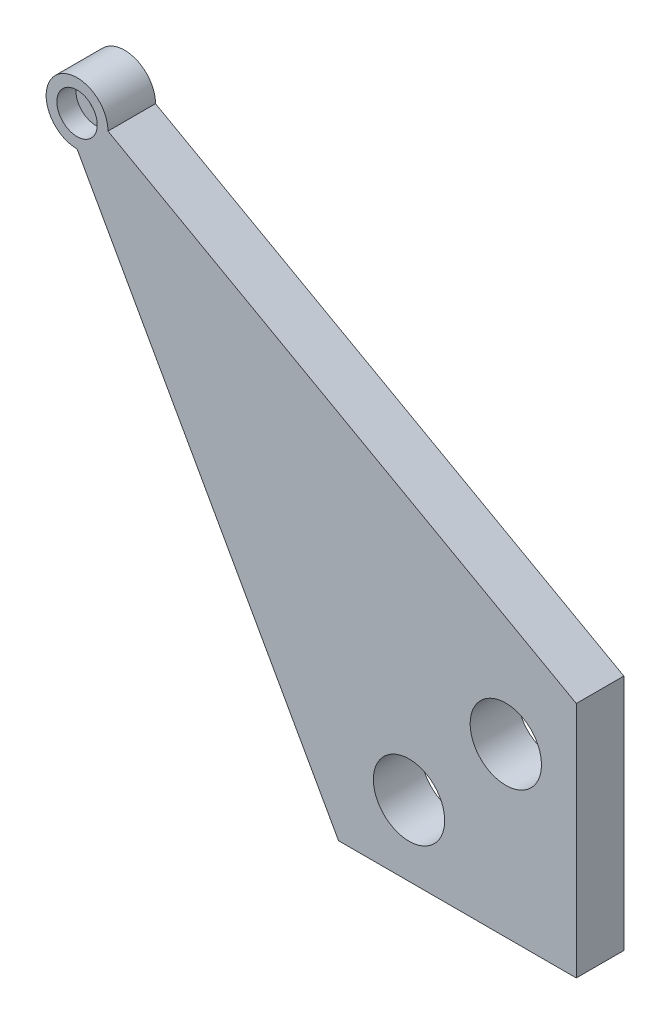
ISO-10303-21;
HEADER;
FILE_DESCRIPTION(('STEP AP214'),'2;1');
FILE_NAME('part.step','',(''),(''),'','','');
FILE_SCHEMA(('AUTOMOTIVE_DESIGN { 1 0 10303 214 1 1 1 1 }'));
ENDSEC;
DATA;
#1=APPLICATION_CONTEXT('core data for automotive mechanical design processes');
#2=APPLICATION_PROTOCOL_DEFINITION('international standard','automotive_design',2000,#1);
#3=PRODUCT_CONTEXT('',#1,'mechanical');
#4=PRODUCT('Part','Part','',(#3));
#5=PRODUCT_RELATED_PRODUCT_CATEGORY('part','',(#4));
#6=PRODUCT_DEFINITION_FORMATION('','',#4);
#7=PRODUCT_DEFINITION_CONTEXT('part definition',#1,'design');
#8=PRODUCT_DEFINITION('design','',#6,#7);
#9=PRODUCT_DEFINITION_SHAPE('','',#8);
#10=(LENGTH_UNIT() NAMED_UNIT(*) SI_UNIT(.MILLI.,.METRE.));
#11=(NAMED_UNIT(*) PLANE_ANGLE_UNIT() SI_UNIT($,.RADIAN.));
#12=(NAMED_UNIT(*) SI_UNIT($,.STERADIAN.) SOLID_ANGLE_UNIT());
#13=UNCERTAINTY_MEASURE_WITH_UNIT(LENGTH_MEASURE(1.E-05),#10,'distance_accuracy_value','');
#14=(GEOMETRIC_REPRESENTATION_CONTEXT(3) GLOBAL_UNCERTAINTY_ASSIGNED_CONTEXT((#13)) GLOBAL_UNIT_ASSIGNED_CONTEXT((#10,
#11,#12)) REPRESENTATION_CONTEXT('',''));
#15=CARTESIAN_POINT('',(0.,0.,0.));
#16=DIRECTION('',(0.,0.,1.));
#17=DIRECTION('',(1.,0.,0.));
#18=AXIS2_PLACEMENT_3D('',#15,#16,#17);
#19=CARTESIAN_POINT('',(0.,0.,5.));
#20=DIRECTION('',(-1.,0.,0.));
#21=DIRECTION('',(0.,1.,0.));
#22=AXIS2_PLACEMENT_3D('',#19,#20,#21);
#23=PLANE('',#22);
#24=DIRECTION('',(0.,-1.,0.));
#25=VECTOR('',#24,1.);
#26=CARTESIAN_POINT('',(0.,0.,-5.));
#27=LINE('',#26,#25);
#28=CARTESIAN_POINT('',(0.,50.,-5.));
#29=VERTEX_POINT('',#28);
#30=CARTESIAN_POINT('',(0.,0.,-5.));
#31=VERTEX_POINT('',#30);
#32=EDGE_CURVE('E119',#29,#31,#27,.T.);
#33=ORIENTED_EDGE('',*,*,#32,.F.);
#34=DIRECTION('',(0.,0.,-1.));
#35=VECTOR('',#34,1.);
#36=CARTESIAN_POINT('',(0.,50.,5.));
#37=LINE('',#36,#35);
#38=CARTESIAN_POINT('',(0.,50.,5.));
#39=VERTEX_POINT('',#38);
#40=EDGE_CURVE('E118',#39,#29,#37,.T.);
#41=ORIENTED_EDGE('',*,*,#40,.F.);
#42=DIRECTION('',(0.,-1.,0.));
#43=VECTOR('',#42,1.);
#44=CARTESIAN_POINT('',(0.,0.,5.));
#45=LINE('',#44,#43);
#46=CARTESIAN_POINT('',(0.,0.,5.));
#47=VERTEX_POINT('',#46);
#48=EDGE_CURVE('E112',#39,#47,#45,.T.);
#49=ORIENTED_EDGE('',*,*,#48,.T.);
#50=DIRECTION('',(0.,0.,-1.));
#51=VECTOR('',#50,1.);
#52=CARTESIAN_POINT('',(0.,0.,5.));
#53=LINE('',#52,#51);
#54=EDGE_CURVE('E11',#47,#31,#53,.T.);
#55=ORIENTED_EDGE('',*,*,#54,.T.);
#56=EDGE_LOOP('',(#33,#41,#49,#55));
#57=FACE_BOUND('',#56,.T.);
#58=ADVANCED_FACE('F38',(#57),#23,.F.);
#59=CARTESIAN_POINT('',(0.,0.,5.));
#60=DIRECTION('',(0.,1.,0.));
#61=DIRECTION('',(0.,0.,1.));
#62=AXIS2_PLACEMENT_3D('',#59,#60,#61);
#63=PLANE('',#62);
#64=DIRECTION('',(-1.,0.,0.));
#65=VECTOR('',#64,1.);
#66=CARTESIAN_POINT('',(0.,0.,-5.));
#67=LINE('',#66,#65);
#68=CARTESIAN_POINT('',(-50.,0.,-5.));
#69=VERTEX_POINT('',#68);
#70=EDGE_CURVE('E122',#31,#69,#67,.T.);
#71=ORIENTED_EDGE('',*,*,#70,.F.);
#72=ORIENTED_EDGE('',*,*,#54,.F.);
#73=DIRECTION('',(-1.,0.,0.));
#74=VECTOR('',#73,1.);
#75=CARTESIAN_POINT('',(0.,0.,5.));
#76=LINE('',#75,#74);
#77=CARTESIAN_POINT('',(-50.,0.,5.));
#78=VERTEX_POINT('',#77);
#79=EDGE_CURVE('E84',#47,#78,#76,.T.);
#80=ORIENTED_EDGE('',*,*,#79,.T.);
#81=DIRECTION('',(0.,0.,-1.));
#82=VECTOR('',#81,1.);
#83=CARTESIAN_POINT('',(-50.,0.,5.));
#84=LINE('',#83,#82);
#85=EDGE_CURVE('E47',#78,#69,#84,.T.);
#86=ORIENTED_EDGE('',*,*,#85,.T.);
#87=EDGE_LOOP('',(#71,#72,#80,#86));
#88=FACE_BOUND('',#87,.T.);
#89=ADVANCED_FACE('F139',(#88),#63,.F.);
#90=CARTESIAN_POINT('',(-50.,0.,5.));
#91=DIRECTION('',(0.873109961084313,0.487523328524236,0.));
#92=DIRECTION('',(0.487523328524236,-0.873109961084313,0.));
#93=AXIS2_PLACEMENT_3D('',#90,#91,#92);
#94=PLANE('',#93);
#95=DIRECTION('',(-0.487523328524236,0.873109961084313,0.));
#96=VECTOR('',#95,1.);
#97=CARTESIAN_POINT('',(-50.,0.,-5.));
#98=LINE('',#97,#96);
#99=CARTESIAN_POINT('',(-105.,98.4999999999999,-5.));
#100=VERTEX_POINT('',#99);
#101=EDGE_CURVE('E127',#69,#100,#98,.T.);
#102=ORIENTED_EDGE('',*,*,#101,.F.);
#103=ORIENTED_EDGE('',*,*,#85,.F.);
#104=DIRECTION('',(-0.487523328524236,0.873109961084313,0.));
#105=VECTOR('',#104,1.);
#106=CARTESIAN_POINT('',(-50.,0.,5.));
#107=LINE('',#106,#105);
#108=CARTESIAN_POINT('',(-105.,98.4999999999999,5.));
#109=VERTEX_POINT('',#108);
#110=EDGE_CURVE('E93',#78,#109,#107,.T.);
#111=ORIENTED_EDGE('',*,*,#110,.T.);
#112=DIRECTION('',(0.,0.,-1.));
#113=VECTOR('',#112,1.);
#114=CARTESIAN_POINT('',(-105.,98.4999999999999,5.));
#115=LINE('',#114,#113);
#116=EDGE_CURVE('E99',#109,#100,#115,.T.);
#117=ORIENTED_EDGE('',*,*,#116,.T.);
#118=EDGE_LOOP('',(#102,#103,#111,#117));
#119=FACE_BOUND('',#118,.T.);
#120=ADVANCED_FACE('F107',(#119),#94,.F.);
#121=CARTESIAN_POINT('',(-105.,105.,5.));
#122=DIRECTION('',(0.,0.,-1.));
#123=DIRECTION('',(1.,0.,0.));
#124=AXIS2_PLACEMENT_3D('',#121,#122,#123);
#125=CYLINDRICAL_SURFACE('',#124,6.50000000000001);
#126=CARTESIAN_POINT('',(-105.,105.,-5.));
#127=DIRECTION('',(0.,0.,-1.));
#128=DIRECTION('',(-1.,0.,0.));
#129=AXIS2_PLACEMENT_3D('',#126,#127,#128);
#130=CIRCLE('',#129,6.50000000000001);
#131=CARTESIAN_POINT('',(-98.5,105.,-5.));
#132=VERTEX_POINT('',#131);
#133=EDGE_CURVE('E101',#100,#132,#130,.T.);
#134=ORIENTED_EDGE('',*,*,#133,.F.);
#135=ORIENTED_EDGE('',*,*,#116,.F.);
#136=CARTESIAN_POINT('',(-105.,105.,5.));
#137=DIRECTION('',(0.,0.,-1.));
#138=DIRECTION('',(-1.,0.,0.));
#139=AXIS2_PLACEMENT_3D('',#136,#137,#138);
#140=CIRCLE('',#139,6.50000000000001);
#141=CARTESIAN_POINT('',(-98.5,105.,5.));
#142=VERTEX_POINT('',#141);
#143=EDGE_CURVE('E89',#109,#142,#140,.T.);
#144=ORIENTED_EDGE('',*,*,#143,.T.);
#145=DIRECTION('',(0.,0.,-1.));
#146=VECTOR('',#145,1.);
#147=CARTESIAN_POINT('',(-98.5,105.,5.));
#148=LINE('',#147,#146);
#149=EDGE_CURVE('E105',#142,#132,#148,.T.);
#150=ORIENTED_EDGE('',*,*,#149,.T.);
#151=EDGE_LOOP('',(#134,#135,#144,#150));
#152=FACE_BOUND('',#151,.T.);
#153=ADVANCED_FACE('F100',(#152),#125,.T.);
#154=CARTESIAN_POINT('',(0.,50.,5.));
#155=DIRECTION('',(-0.487523328524235,-0.873109961084313,0.));
#156=DIRECTION('',(-0.873109961084313,0.487523328524235,0.));
#157=AXIS2_PLACEMENT_3D('',#154,#155,#156);
#158=PLANE('',#157);
#159=DIRECTION('',(0.873109961084313,-0.487523328524235,0.));
#160=VECTOR('',#159,1.);
#161=CARTESIAN_POINT('',(0.,50.,-5.));
#162=LINE('',#161,#160);
#163=EDGE_CURVE('E72',#132,#29,#162,.T.);
#164=ORIENTED_EDGE('',*,*,#163,.F.);
#165=ORIENTED_EDGE('',*,*,#149,.F.);
#166=DIRECTION('',(0.873109961084313,-0.487523328524235,0.));
#167=VECTOR('',#166,1.);
#168=CARTESIAN_POINT('',(0.,50.,5.));
#169=LINE('',#168,#167);
#170=EDGE_CURVE('E55',#142,#39,#169,.T.);
#171=ORIENTED_EDGE('',*,*,#170,.T.);
#172=ORIENTED_EDGE('',*,*,#40,.T.);
#173=EDGE_LOOP('',(#164,#165,#171,#172));
#174=FACE_BOUND('',#173,.T.);
#175=ADVANCED_FACE('F209',(#174),#158,.F.);
#176=CARTESIAN_POINT('',(-105.,105.,5.));
#177=DIRECTION('',(0.,0.,1.));
#178=DIRECTION('',(-1.,0.,0.));
#179=AXIS2_PLACEMENT_3D('',#176,#177,#178);
#180=PLANE('',#179);
#181=CARTESIAN_POINT('',(-14.8255588340632,35.1744411659368,5.));
#182=DIRECTION('',(0.,0.,-1.));
#183=DIRECTION('',(-1.,0.,0.));
#184=AXIS2_PLACEMENT_3D('',#181,#182,#183);
#185=CIRCLE('',#184,7.5);
#186=CARTESIAN_POINT('',(-22.3255588340632,35.1744411659368,5.));
#187=VERTEX_POINT('',#186);
#188=EDGE_CURVE('E171',#187,#187,#185,.T.);
#189=ORIENTED_EDGE('',*,*,#188,.T.);
#190=EDGE_LOOP('',(#189));
#191=FACE_BOUND('',#190,.T.);
#192=CARTESIAN_POINT('',(-35.1744411659368,14.8255588340632,5.));
#193=DIRECTION('',(0.,0.,-1.));
#194=DIRECTION('',(-1.,0.,0.));
#195=AXIS2_PLACEMENT_3D('',#192,#193,#194);
#196=CIRCLE('',#195,7.5);
#197=CARTESIAN_POINT('',(-42.6744411659368,14.8255588340632,5.));
#198=VERTEX_POINT('',#197);
#199=EDGE_CURVE('E163',#198,#198,#196,.T.);
#200=ORIENTED_EDGE('',*,*,#199,.T.);
#201=EDGE_LOOP('',(#200));
#202=FACE_BOUND('',#201,.T.);
#203=CARTESIAN_POINT('',(-105.,105.,5.));
#204=DIRECTION('',(0.,0.,-1.));
#205=DIRECTION('',(-1.,0.,0.));
#206=AXIS2_PLACEMENT_3D('',#203,#204,#205);
#207=CIRCLE('',#206,4.25000000000001);
#208=CARTESIAN_POINT('',(-109.25,105.,5.));
#209=VERTEX_POINT('',#208);
#210=EDGE_CURVE('E147',#209,#209,#207,.T.);
#211=ORIENTED_EDGE('',*,*,#210,.T.);
#212=EDGE_LOOP('',(#211));
#213=FACE_BOUND('',#212,.T.);
#214=ORIENTED_EDGE('',*,*,#48,.F.);
#215=ORIENTED_EDGE('',*,*,#170,.F.);
#216=ORIENTED_EDGE('',*,*,#143,.F.);
#217=ORIENTED_EDGE('',*,*,#110,.F.);
#218=ORIENTED_EDGE('',*,*,#79,.F.);
#219=EDGE_LOOP('',(#214,#215,#216,#217,#218));
#220=FACE_BOUND('',#219,.T.);
#221=ADVANCED_FACE('F91',(#191,#202,#213,#220),#180,.T.);
#222=CARTESIAN_POINT('',(-105.,105.,-5.));
#223=DIRECTION('',(0.,0.,1.));
#224=DIRECTION('',(-1.,0.,0.));
#225=AXIS2_PLACEMENT_3D('',#222,#223,#224);
#226=PLANE('',#225);
#227=CARTESIAN_POINT('',(-14.8255588340632,35.1744411659368,-5.));
#228=DIRECTION('',(0.,0.,-1.));
#229=DIRECTION('',(-1.,0.,0.));
#230=AXIS2_PLACEMENT_3D('',#227,#228,#229);
#231=CIRCLE('',#230,7.5);
#232=CARTESIAN_POINT('',(-22.3255588340632,35.1744411659368,-5.));
#233=VERTEX_POINT('',#232);
#234=EDGE_CURVE('E159',#233,#233,#231,.T.);
#235=ORIENTED_EDGE('',*,*,#234,.F.);
#236=EDGE_LOOP('',(#235));
#237=FACE_BOUND('',#236,.T.);
#238=CARTESIAN_POINT('',(-35.1744411659368,14.8255588340632,-5.));
#239=DIRECTION('',(0.,0.,-1.));
#240=DIRECTION('',(-1.,0.,0.));
#241=AXIS2_PLACEMENT_3D('',#238,#239,#240);
#242=CIRCLE('',#241,7.5);
#243=CARTESIAN_POINT('',(-42.6744411659368,14.8255588340632,-5.));
#244=VERTEX_POINT('',#243);
#245=EDGE_CURVE('E167',#244,#244,#242,.T.);
#246=ORIENTED_EDGE('',*,*,#245,.F.);
#247=EDGE_LOOP('',(#246));
#248=FACE_BOUND('',#247,.T.);
#249=CARTESIAN_POINT('',(-105.,105.,-5.));
#250=DIRECTION('',(0.,0.,-1.));
#251=DIRECTION('',(-1.,0.,0.));
#252=AXIS2_PLACEMENT_3D('',#249,#250,#251);
#253=CIRCLE('',#252,1.5);
#254=CARTESIAN_POINT('',(-106.5,105.,-5.));
#255=VERTEX_POINT('',#254);
#256=EDGE_CURVE('E151',#255,#255,#253,.T.);
#257=ORIENTED_EDGE('',*,*,#256,.F.);
#258=EDGE_LOOP('',(#257));
#259=FACE_BOUND('',#258,.T.);
#260=ORIENTED_EDGE('',*,*,#32,.T.);
#261=ORIENTED_EDGE('',*,*,#70,.T.);
#262=ORIENTED_EDGE('',*,*,#101,.T.);
#263=ORIENTED_EDGE('',*,*,#133,.T.);
#264=ORIENTED_EDGE('',*,*,#163,.T.);
#265=EDGE_LOOP('',(#260,#261,#262,#263,#264));
#266=FACE_BOUND('',#265,.T.);
#267=ADVANCED_FACE('F140',(#237,#248,#259,#266),#226,.F.);
#268=CARTESIAN_POINT('',(-105.,105.,1.));
#269=DIRECTION('',(0.,0.,1.));
#270=DIRECTION('',(-1.,0.,0.));
#271=AXIS2_PLACEMENT_3D('',#268,#269,#270);
#272=CYLINDRICAL_SURFACE('',#271,4.25000000000001);
#273=CARTESIAN_POINT('',(-105.,105.,1.));
#274=DIRECTION('',(0.,0.,-1.));
#275=DIRECTION('',(-1.,0.,0.));
#276=AXIS2_PLACEMENT_3D('',#273,#274,#275);
#277=CIRCLE('',#276,4.25000000000001);
#278=CARTESIAN_POINT('',(-109.25,105.,1.));
#279=VERTEX_POINT('',#278);
#280=EDGE_CURVE('E123',#279,#279,#277,.T.);
#281=ORIENTED_EDGE('',*,*,#280,.T.);
#282=EDGE_LOOP('',(#281));
#283=FACE_BOUND('',#282,.T.);
#284=ORIENTED_EDGE('',*,*,#210,.F.);
#285=EDGE_LOOP('',(#284));
#286=FACE_BOUND('',#285,.T.);
#287=ADVANCED_FACE('F184',(#283,#286),#272,.F.);
#288=CARTESIAN_POINT('',(-105.,105.,1.));
#289=DIRECTION('',(0.,0.,1.));
#290=DIRECTION('',(-1.,0.,0.));
#291=AXIS2_PLACEMENT_3D('',#288,#289,#290);
#292=PLANE('',#291);
#293=CARTESIAN_POINT('',(-105.,105.,1.));
#294=DIRECTION('',(0.,0.,-1.));
#295=DIRECTION('',(-1.,0.,0.));
#296=AXIS2_PLACEMENT_3D('',#293,#294,#295);
#297=CIRCLE('',#296,1.5);
#298=CARTESIAN_POINT('',(-106.5,105.,1.));
#299=VERTEX_POINT('',#298);
#300=EDGE_CURVE('E155',#299,#299,#297,.T.);
#301=ORIENTED_EDGE('',*,*,#300,.T.);
#302=EDGE_LOOP('',(#301));
#303=FACE_BOUND('',#302,.T.);
#304=ORIENTED_EDGE('',*,*,#280,.F.);
#305=EDGE_LOOP('',(#304));
#306=FACE_BOUND('',#305,.T.);
#307=ADVANCED_FACE('F194',(#303,#306),#292,.T.);
#308=CARTESIAN_POINT('',(-105.,105.,-5.));
#309=DIRECTION('',(0.,0.,1.));
#310=DIRECTION('',(-1.,0.,0.));
#311=AXIS2_PLACEMENT_3D('',#308,#309,#310);
#312=CYLINDRICAL_SURFACE('',#311,1.5);
#313=ORIENTED_EDGE('',*,*,#256,.T.);
#314=EDGE_LOOP('',(#313));
#315=FACE_BOUND('',#314,.T.);
#316=ORIENTED_EDGE('',*,*,#300,.F.);
#317=EDGE_LOOP('',(#316));
#318=FACE_BOUND('',#317,.T.);
#319=ADVANCED_FACE('F190',(#315,#318),#312,.F.);
#320=CARTESIAN_POINT('',(-35.1744411659368,14.8255588340632,-5.));
#321=DIRECTION('',(0.,0.,1.));
#322=DIRECTION('',(-1.,0.,0.));
#323=AXIS2_PLACEMENT_3D('',#320,#321,#322);
#324=CYLINDRICAL_SURFACE('',#323,7.5);
#325=ORIENTED_EDGE('',*,*,#245,.T.);
#326=EDGE_LOOP('',(#325));
#327=FACE_BOUND('',#326,.T.);
#328=ORIENTED_EDGE('',*,*,#199,.F.);
#329=EDGE_LOOP('',(#328));
#330=FACE_BOUND('',#329,.T.);
#331=ADVANCED_FACE('F193',(#327,#330),#324,.F.);
#332=CARTESIAN_POINT('',(-14.8255588340632,35.1744411659368,-5.));
#333=DIRECTION('',(0.,0.,1.));
#334=DIRECTION('',(-1.,0.,0.));
#335=AXIS2_PLACEMENT_3D('',#332,#333,#334);
#336=CYLINDRICAL_SURFACE('',#335,7.5);
#337=ORIENTED_EDGE('',*,*,#234,.T.);
#338=EDGE_LOOP('',(#337));
#339=FACE_BOUND('',#338,.T.);
#340=ORIENTED_EDGE('',*,*,#188,.F.);
#341=EDGE_LOOP('',(#340));
#342=FACE_BOUND('',#341,.T.);
#343=ADVANCED_FACE('F179',(#339,#342),#336,.F.);
#344=CLOSED_SHELL('',(#58,#89,#120,#153,#175,#221,#267,#287,#307,#319,#331,#343));
#345=MANIFOLD_SOLID_BREP('B2',#344);
#346=ADVANCED_BREP_SHAPE_REPRESENTATION('',(#18,#345),#14);
#347=SHAPE_DEFINITION_REPRESENTATION(#9,#346);
ENDSEC;
END-ISO-10303-21;
